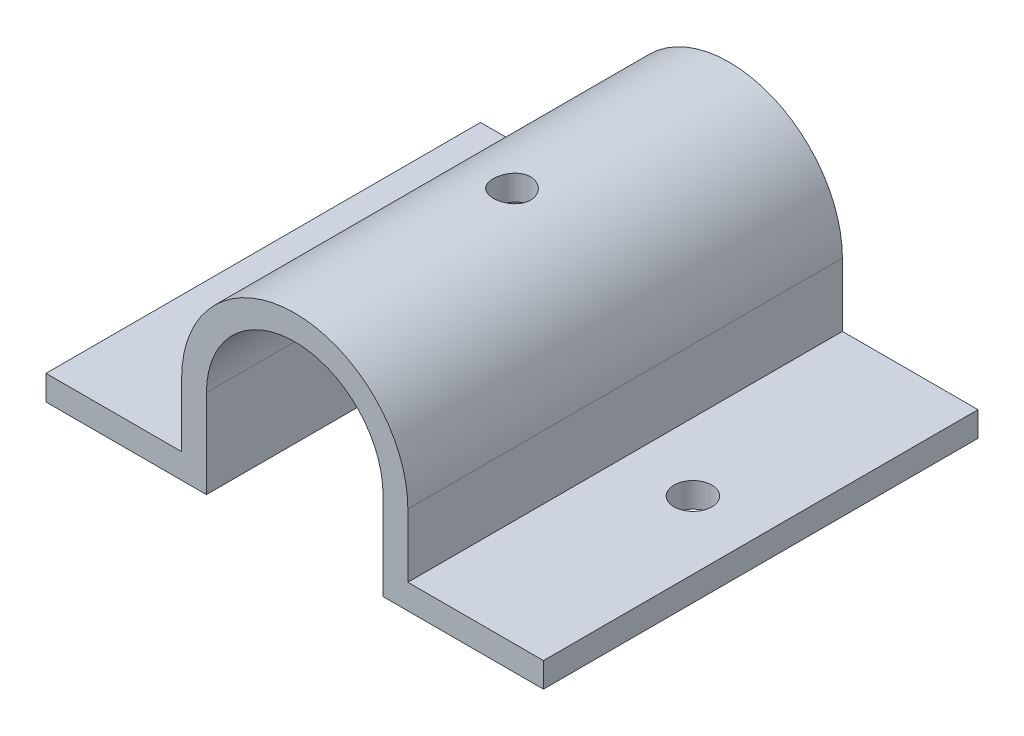
ISO-10303-21;
HEADER;
FILE_DESCRIPTION(('STEP AP214'),'2;1');
FILE_NAME('part.step','',(''),(''),'','','');
FILE_SCHEMA(('AUTOMOTIVE_DESIGN { 1 0 10303 214 1 1 1 1 }'));
ENDSEC;
DATA;
#1=APPLICATION_CONTEXT('core data for automotive mechanical design processes');
#2=APPLICATION_PROTOCOL_DEFINITION('international standard','automotive_design',2000,#1);
#3=PRODUCT_CONTEXT('',#1,'mechanical');
#4=PRODUCT('Part','Part','',(#3));
#5=PRODUCT_RELATED_PRODUCT_CATEGORY('part','',(#4));
#6=PRODUCT_DEFINITION_FORMATION('','',#4);
#7=PRODUCT_DEFINITION_CONTEXT('part definition',#1,'design');
#8=PRODUCT_DEFINITION('design','',#6,#7);
#9=PRODUCT_DEFINITION_SHAPE('','',#8);
#10=(LENGTH_UNIT() NAMED_UNIT(*) SI_UNIT(.MILLI.,.METRE.));
#11=(NAMED_UNIT(*) PLANE_ANGLE_UNIT() SI_UNIT($,.RADIAN.));
#12=(NAMED_UNIT(*) SI_UNIT($,.STERADIAN.) SOLID_ANGLE_UNIT());
#13=UNCERTAINTY_MEASURE_WITH_UNIT(LENGTH_MEASURE(1.E-05),#10,'distance_accuracy_value','');
#14=(GEOMETRIC_REPRESENTATION_CONTEXT(3) GLOBAL_UNCERTAINTY_ASSIGNED_CONTEXT((#13)) GLOBAL_UNIT_ASSIGNED_CONTEXT((#10,
#11,#12)) REPRESENTATION_CONTEXT('',''));
#15=CARTESIAN_POINT('',(0.,0.,0.));
#16=DIRECTION('',(0.,0.,1.));
#17=DIRECTION('',(1.,0.,0.));
#18=AXIS2_PLACEMENT_3D('',#15,#16,#17);
#19=CARTESIAN_POINT('',(0.,10.224,70.));
#20=DIRECTION('',(0.,0.,-1.));
#21=DIRECTION('',(-1.,0.,0.));
#22=AXIS2_PLACEMENT_3D('',#19,#20,#21);
#23=CYLINDRICAL_SURFACE('',#22,18.224);
#24=DIRECTION('',(0.,0.,-1.));
#25=VECTOR('',#24,1.);
#26=CARTESIAN_POINT('',(-18.224,10.224,70.));
#27=LINE('',#26,#25);
#28=CARTESIAN_POINT('',(-18.224,10.224,70.));
#29=VERTEX_POINT('',#28);
#30=CARTESIAN_POINT('',(-18.224,10.224,0.));
#31=VERTEX_POINT('',#30);
#32=EDGE_CURVE('E185',#29,#31,#27,.T.);
#33=ORIENTED_EDGE('',*,*,#32,.F.);
#34=CARTESIAN_POINT('',(0.,10.224,70.));
#35=DIRECTION('',(0.,0.,1.));
#36=DIRECTION('',(1.,0.,0.));
#37=AXIS2_PLACEMENT_3D('',#34,#35,#36);
#38=CIRCLE('',#37,18.224);
#39=CARTESIAN_POINT('',(18.224,10.224,70.));
#40=VERTEX_POINT('',#39);
#41=EDGE_CURVE('E56',#40,#29,#38,.T.);
#42=ORIENTED_EDGE('',*,*,#41,.F.);
#43=DIRECTION('',(0.,0.,-1.));
#44=VECTOR('',#43,1.);
#45=CARTESIAN_POINT('',(18.224,10.224,70.));
#46=LINE('',#45,#44);
#47=CARTESIAN_POINT('',(18.224,10.224,0.));
#48=VERTEX_POINT('',#47);
#49=EDGE_CURVE('E189',#48,#40,#46,.F.);
#50=ORIENTED_EDGE('',*,*,#49,.F.);
#51=CARTESIAN_POINT('',(0.,10.224,0.));
#52=DIRECTION('',(0.,0.,1.));
#53=DIRECTION('',(1.,0.,0.));
#54=AXIS2_PLACEMENT_3D('',#51,#52,#53);
#55=CIRCLE('',#54,18.224);
#56=EDGE_CURVE('E11',#31,#48,#55,.F.);
#57=ORIENTED_EDGE('',*,*,#56,.F.);
#58=EDGE_LOOP('',(#33,#42,#50,#57));
#59=FACE_BOUND('',#58,.T.);
#60=CARTESIAN_POINT('',(0.,28.448,32.));
#61=CARTESIAN_POINT('',(0.167299124044914,28.4479971539085,32.0000067341063));
#62=CARTESIAN_POINT('',(0.334690294820282,28.445672237168,32.0140417688915));
#63=CARTESIAN_POINT('',(0.664779884903891,28.4366215461761,32.0697889102327));
#64=CARTESIAN_POINT('',(0.827473810437679,28.4298916945475,32.1115266599904));
#65=CARTESIAN_POINT('',(1.14334525844181,28.4127861608961,32.2213865903458));
#66=CARTESIAN_POINT('',(1.29653037349707,28.4024134328713,32.2894873977791));
#67=CARTESIAN_POINT('',(1.58927966007172,28.3791633858742,32.4500848202931));
#68=CARTESIAN_POINT('',(1.7288454293843,28.3662863612326,32.5425785689195));
#69=CARTESIAN_POINT('',(1.99171731585958,28.3393213718147,32.7502551103151));
#70=CARTESIAN_POINT('',(2.11487783283978,28.3252241880854,32.8656210228177));
#71=CARTESIAN_POINT('',(2.34018562746127,28.2974784864303,33.115372935266));
#72=CARTESIAN_POINT('',(2.44233159423126,28.2838299965385,33.2497601208618));
#73=CARTESIAN_POINT('',(2.62329211089869,28.2584377082811,33.5347372042175));
#74=CARTESIAN_POINT('',(2.70196307924593,28.2467058223177,33.6854194302803));
#75=CARTESIAN_POINT('',(2.83282231482439,28.2266027076354,33.9980852336073));
#76=CARTESIAN_POINT('',(2.88501232608604,28.2182312576064,34.1600680658162));
#77=CARTESIAN_POINT('',(2.96097025680633,28.205888481575,34.4891951102072));
#78=CARTESIAN_POINT('',(2.98498928001448,28.2018783048586,34.6562798867601));
#79=CARTESIAN_POINT('',(3.00470188721067,28.1985945419204,34.992152592287));
#80=CARTESIAN_POINT('',(3.00039742694859,28.1993206286575,35.160940402862));
#81=CARTESIAN_POINT('',(2.96378987339782,28.2053918759166,35.4936377999609));
#82=CARTESIAN_POINT('',(2.93176854940041,28.2106905499457,35.6575793619086));
#83=CARTESIAN_POINT('',(2.84107828655088,28.225237196098,35.9777308254392));
#84=CARTESIAN_POINT('',(2.78240845415425,28.2344853006482,36.1339404675702));
#85=CARTESIAN_POINT('',(2.63979997609019,28.2559391406125,36.4350391673364));
#86=CARTESIAN_POINT('',(2.55574402465862,28.2681585538277,36.5798716511803));
#87=CARTESIAN_POINT('',(2.36483266723982,28.2941686451239,36.8534831251096));
#88=CARTESIAN_POINT('',(2.25797546507636,28.3079594469517,36.982260849209));
#89=CARTESIAN_POINT('',(2.02295820200398,28.3357628440847,37.2217385483281));
#90=CARTESIAN_POINT('',(1.89455632225164,28.3497761057749,37.3322012687672));
#91=CARTESIAN_POINT('',(1.62091321950006,28.3762913442798,37.5300486117945));
#92=CARTESIAN_POINT('',(1.47567189286951,28.3887933117928,37.6174330923464));
#93=CARTESIAN_POINT('',(1.17225192263358,28.4108944542093,37.766663812495));
#94=CARTESIAN_POINT('',(1.01406295694143,28.4204912838797,37.8284894338115));
#95=CARTESIAN_POINT('',(0.689353554083484,28.4356819221253,37.9246290414899));
#96=CARTESIAN_POINT('',(0.522833797832243,28.4412760572893,37.9589452724329));
#97=CARTESIAN_POINT('',(0.188234965941305,28.4477871680977,37.9987711484278));
#98=CARTESIAN_POINT('',(0.0201956574261365,28.4487570330075,38.0046065561587));
#99=CARTESIAN_POINT('',(-0.314459906102683,28.4460550710995,37.9881731454562));
#100=CARTESIAN_POINT('',(-0.48107621425219,28.4423834183689,37.9659053810757));
#101=CARTESIAN_POINT('',(-0.807152432989453,28.4308437140995,37.8941686696864));
#102=CARTESIAN_POINT('',(-0.966648707284983,28.4230005008464,37.8448606720651));
#103=CARTESIAN_POINT('',(-1.27511087521852,28.4039936851116,37.7206145075309));
#104=CARTESIAN_POINT('',(-1.42407618902093,28.3928298999749,37.6456749306653));
#105=CARTESIAN_POINT('',(-1.70866509770227,28.3682894647038,37.471544440836));
#106=CARTESIAN_POINT('',(-1.84416232963958,28.3548945325588,37.3721496333929));
#107=CARTESIAN_POINT('',(-2.09667012254975,28.3274337156497,37.152211048991));
#108=CARTESIAN_POINT('',(-2.21367937442292,28.313367783465,37.0316657756811));
#109=CARTESIAN_POINT('',(-2.42709443529209,28.2859796912587,36.7713884227259));
#110=CARTESIAN_POINT('',(-2.52328036173882,28.272666471563,36.6314749613636));
#111=CARTESIAN_POINT('',(-2.69078368595544,28.2484570435089,36.3372850671211));
#112=CARTESIAN_POINT('',(-2.76210185792337,28.2375607599088,36.1830090815731));
#113=CARTESIAN_POINT('',(-2.87751482008493,28.2194857088285,35.8650935095243));
#114=CARTESIAN_POINT('',(-2.92171985852187,28.2122919056842,35.7014948398381));
#115=CARTESIAN_POINT('',(-2.98199919531677,28.2023983146206,35.3690663841174));
#116=CARTESIAN_POINT('',(-2.99807587380651,28.1996981464652,35.200237041916));
#117=CARTESIAN_POINT('',(-3.00157700134136,28.1991136589167,34.8643348324813));
#118=CARTESIAN_POINT('',(-2.98934750480094,28.2011711746202,34.6972655722682));
#119=CARTESIAN_POINT('',(-2.9373308555924,28.2097428851364,34.3675961425262));
#120=CARTESIAN_POINT('',(-2.89754378602022,28.2162570665107,34.204995959523));
#121=CARTESIAN_POINT('',(-2.79167267970661,28.2329862461924,33.8890092785143));
#122=CARTESIAN_POINT('',(-2.72561772162453,28.2431971510957,33.735612807346));
#123=CARTESIAN_POINT('',(-2.56912129022992,28.2661733557303,33.4420231486762));
#124=CARTESIAN_POINT('',(-2.47867865597287,28.2789387770587,33.3018305901592));
#125=CARTESIAN_POINT('',(-2.27473630303179,28.3057704110737,33.0368786633187));
#126=CARTESIAN_POINT('',(-2.16098176883172,28.3198499723705,32.9123167594263));
#127=CARTESIAN_POINT('',(-1.91418223159012,28.3476163731598,32.6839304807071));
#128=CARTESIAN_POINT('',(-1.78113277946749,28.361303121202,32.5801109018724));
#129=CARTESIAN_POINT('',(-1.49845857099829,28.3868481902959,32.3955202875973));
#130=CARTESIAN_POINT('',(-1.34872842123199,28.3986936041133,32.3149088526077));
#131=CARTESIAN_POINT('',(-1.03771948484296,28.419095652842,32.1801055452658));
#132=CARTESIAN_POINT('',(-0.876452445689334,28.4276555782174,32.1258872251469));
#133=CARTESIAN_POINT('',(-0.59545499454717,28.4386431351784,32.0572458530717));
#134=CARTESIAN_POINT('',(-0.477429107535469,28.4421332991642,32.0358128354397));
#135=CARTESIAN_POINT('',(-0.239617869195298,28.446812731827,32.0071876150236));
#136=CARTESIAN_POINT('',(-0.119832547024065,28.4480020385904,31.9999951765132));
#137=CARTESIAN_POINT('',(0.,28.448,32.));
#138=B_SPLINE_CURVE_WITH_KNOTS('',3,(#60,#61,#62,#63,#64,#65,#66,#67,#68,#69,#70,#71,#72,#73,
#74,#75,#76,#77,#78,#79,#80,#81,#82,#83,#84,#85,#86,#87,#88,#89,#90,#91,#92,#93,#94,#95,#96,#97,
#98,#99,#100,#101,#102,#103,#104,#105,#106,#107,#108,#109,#110,#111,#112,#113,#114,#115,#116,
#117,#118,#119,#120,#121,#122,#123,#124,#125,#126,#127,#128,#129,#130,#131,#132,#133,#134,#135,
#136,#137),.UNSPECIFIED.,.T.,.F.,(4,2,2,2,2,2,2,2,2,2,2,2,2,2,2,2,2,2,2,2,2,2,2,2,2,2,2,2,2,2,2,
2,2,2,2,2,2,2,4),(0.,0.501459367682181,1.00338356311634,1.50490168587903,2.00636090066942,
2.51201002991263,3.01769069159789,3.52640370326369,4.03508320684409,4.53919325105569,
5.04326848659663,5.54227869450985,6.04130563584572,6.54267474041433,7.04408335509407,
7.55155095701753,8.05902168210316,8.56690098769929,9.07473884954361,9.57675424317567,
10.0787508085056,10.5777913103657,11.0768592680726,11.5802382412802,12.0836528418643,
12.5921486783943,13.1006286827089,13.6070271403269,14.1133827460558,14.6135807004621,
15.1137771465992,15.6134214078134,16.1130894581617,16.618542294198,17.1241118649542,
17.633079399182,18.1415358566704,18.5007257109108,18.8599096193831),.UNSPECIFIED.);
#139=CARTESIAN_POINT('',(0.,28.448,32.));
#140=VERTEX_POINT('',#139);
#141=EDGE_CURVE('E306',#140,#140,#138,.T.);
#142=ORIENTED_EDGE('',*,*,#141,.T.);
#143=EDGE_LOOP('',(#142));
#144=FACE_BOUND('',#143,.T.);
#145=ADVANCED_FACE('F41',(#59,#144),#23,.T.);
#146=CARTESIAN_POINT('',(0.,10.224,0.));
#147=DIRECTION('',(0.,0.,-1.));
#148=DIRECTION('',(-1.,0.,0.));
#149=AXIS2_PLACEMENT_3D('',#146,#147,#148);
#150=CYLINDRICAL_SURFACE('',#149,14.224);
#151=DIRECTION('',(0.,0.,1.));
#152=VECTOR('',#151,1.);
#153=CARTESIAN_POINT('',(-14.224,10.224,0.));
#154=LINE('',#153,#152);
#155=CARTESIAN_POINT('',(-14.224,10.224,0.));
#156=VERTEX_POINT('',#155);
#157=CARTESIAN_POINT('',(-14.224,10.224,70.));
#158=VERTEX_POINT('',#157);
#159=EDGE_CURVE('E165',#156,#158,#154,.T.);
#160=ORIENTED_EDGE('',*,*,#159,.F.);
#161=CARTESIAN_POINT('',(0.,10.224,0.));
#162=DIRECTION('',(0.,0.,1.));
#163=DIRECTION('',(1.,0.,0.));
#164=AXIS2_PLACEMENT_3D('',#161,#162,#163);
#165=CIRCLE('',#164,14.224);
#166=CARTESIAN_POINT('',(14.224,10.224,0.));
#167=VERTEX_POINT('',#166);
#168=EDGE_CURVE('E179',#156,#167,#165,.F.);
#169=ORIENTED_EDGE('',*,*,#168,.T.);
#170=DIRECTION('',(0.,0.,1.));
#171=VECTOR('',#170,1.);
#172=CARTESIAN_POINT('',(14.224,10.224,0.));
#173=LINE('',#172,#171);
#174=CARTESIAN_POINT('',(14.224,10.224,70.));
#175=VERTEX_POINT('',#174);
#176=EDGE_CURVE('E170',#175,#167,#173,.F.);
#177=ORIENTED_EDGE('',*,*,#176,.F.);
#178=CARTESIAN_POINT('',(0.,10.224,70.));
#179=DIRECTION('',(0.,0.,1.));
#180=DIRECTION('',(1.,0.,0.));
#181=AXIS2_PLACEMENT_3D('',#178,#179,#180);
#182=CIRCLE('',#181,14.224);
#183=EDGE_CURVE('E182',#175,#158,#182,.T.);
#184=ORIENTED_EDGE('',*,*,#183,.T.);
#185=EDGE_LOOP('',(#160,#169,#177,#184));
#186=FACE_BOUND('',#185,.T.);
#187=CARTESIAN_POINT('',(0.,24.448,32.));
#188=CARTESIAN_POINT('',(0.166534448824368,24.4479969171993,32.0000058837209));
#189=CARTESIAN_POINT('',(0.333141369406627,24.4450454766761,32.0139136958404));
#190=CARTESIAN_POINT('',(0.661632670716217,24.4335564990513,32.0691255421016));
#191=CARTESIAN_POINT('',(0.823513420733723,24.4250147795509,32.1104500885462));
#192=CARTESIAN_POINT('',(1.13775663539406,24.4032974768358,32.219151353765));
#193=CARTESIAN_POINT('',(1.29012851240539,24.3901265643387,32.28650181995));
#194=CARTESIAN_POINT('',(1.58140202253015,24.3605767762521,32.4452620059277));
#195=CARTESIAN_POINT('',(1.72030419628154,24.3441980294964,32.5366707595375));
#196=CARTESIAN_POINT('',(1.98278359023566,24.3097561047365,32.7424028755333));
#197=CARTESIAN_POINT('',(2.10613007766223,24.2916732677522,32.8570173498451));
#198=CARTESIAN_POINT('',(2.3319972546501,24.2560016378524,33.1052820938101));
#199=CARTESIAN_POINT('',(2.43451618887704,24.2384128866857,33.238933966311));
#200=CARTESIAN_POINT('',(2.61682078371807,24.2055278958289,33.5231658480152));
#201=CARTESIAN_POINT('',(2.69636368169512,24.1902568928848,33.6739047432992));
#202=CARTESIAN_POINT('',(2.82890192704633,24.1640173835291,33.986984324168));
#203=CARTESIAN_POINT('',(2.88190021062039,24.1530484012838,34.1493237243063));
#204=CARTESIAN_POINT('',(2.95908799837252,24.1368545620503,34.4785017724602));
#205=CARTESIAN_POINT('',(2.98368446341771,24.1315486465746,34.6452409223954));
#206=CARTESIAN_POINT('',(3.00463524003697,24.1270380289074,34.980557085779));
#207=CARTESIAN_POINT('',(3.00099277174928,24.1278326310622,35.1491338874874));
#208=CARTESIAN_POINT('',(2.96589723086016,24.135359770301,35.4803353288221));
#209=CARTESIAN_POINT('',(2.93491423009095,24.1419919359762,35.6430124037562));
#210=CARTESIAN_POINT('',(2.84676067908167,24.1602885123523,35.9608065527089));
#211=CARTESIAN_POINT('',(2.78958875257814,24.1719531875165,36.1159232289441));
#212=CARTESIAN_POINT('',(2.65024129480415,24.1991009603208,36.4155290429559));
#213=CARTESIAN_POINT('',(2.56788264020845,24.2146118607556,36.559930385678));
#214=CARTESIAN_POINT('',(2.38062853387459,24.2476870090461,36.8330383972366));
#215=CARTESIAN_POINT('',(2.27573021520629,24.2652515179807,36.9617430662687));
#216=CARTESIAN_POINT('',(2.04387393750525,24.3008872564116,37.2025132686311));
#217=CARTESIAN_POINT('',(1.91651561630804,24.3189615820658,37.3141931597636));
#218=CARTESIAN_POINT('',(1.64467659983275,24.3532587615725,37.5146690250277));
#219=CARTESIAN_POINT('',(1.50019563520568,24.3694815862921,37.6034646391067));
#220=CARTESIAN_POINT('',(1.19776003968224,24.3982948808393,37.7557363514558));
#221=CARTESIAN_POINT('',(1.03978066152958,24.4108784852319,37.8191646791863));
#222=CARTESIAN_POINT('',(0.715082614326171,24.4309440629264,37.9184702765698));
#223=CARTESIAN_POINT('',(0.548365128301941,24.4384267249183,37.9543512655353));
#224=CARTESIAN_POINT('',(0.214233854025719,24.4473502021502,37.9969891392868));
#225=CARTESIAN_POINT('',(0.0468901749998554,24.448900372092,38.004273221883));
#226=CARTESIAN_POINT('',(-0.286622875356345,24.4460894903316,37.9909355511944));
#227=CARTESIAN_POINT('',(-0.452792319810776,24.4417288100405,37.9703155512758));
#228=CARTESIAN_POINT('',(-0.777512848720063,24.4276549612312,37.9021925936075));
#229=CARTESIAN_POINT('',(-0.936123978959533,24.4179963631904,37.8549635859079));
#230=CARTESIAN_POINT('',(-1.24317423803891,24.394406738049,37.735265325538));
#231=CARTESIAN_POINT('',(-1.39161254221399,24.380475365074,37.6627940294796));
#232=CARTESIAN_POINT('',(-1.67630212939961,24.3496145124865,37.4935520086599));
#233=CARTESIAN_POINT('',(-1.81236315950423,24.3326473121614,37.3964682790258));
#234=CARTESIAN_POINT('',(-2.06645190042335,24.2976786696516,37.1811723504249));
#235=CARTESIAN_POINT('',(-2.18447744155508,24.2796771033898,37.0629576130882));
#236=CARTESIAN_POINT('',(-2.40120813985781,24.2442947616685,36.8063440862841));
#237=CARTESIAN_POINT('',(-2.49954953336831,24.2269298059499,36.6676354958221));
#238=CARTESIAN_POINT('',(-2.67154102687901,24.1951390157046,36.3753601364613));
#239=CARTESIAN_POINT('',(-2.74519216598177,24.1807130574986,36.2217939932011));
#240=CARTESIAN_POINT('',(-2.86523387773224,24.1565648721724,35.9049689312993));
#241=CARTESIAN_POINT('',(-2.91177324014204,24.1468170245508,35.7417684353263));
#242=CARTESIAN_POINT('',(-2.97671326593432,24.1330789000531,35.4096336102171));
#243=CARTESIAN_POINT('',(-2.99511806893683,24.1290877761579,35.2407001283521));
#244=CARTESIAN_POINT('',(-3.00310006654725,24.1273656763544,34.9055556159256));
#245=CARTESIAN_POINT('',(-2.9932531455964,24.1295096401835,34.7393586809924));
#246=CARTESIAN_POINT('',(-2.9462916168691,24.1395347702751,34.411048466695));
#247=CARTESIAN_POINT('',(-2.90917728492387,24.1474158785018,34.248935146039));
#248=CARTESIAN_POINT('',(-2.80900373402067,24.1679684623819,33.9338125192474));
#249=CARTESIAN_POINT('',(-2.74602270024136,24.1806254929548,33.7807773549646));
#250=CARTESIAN_POINT('',(-2.59597290090526,24.2093104998046,33.4873582635846));
#251=CARTESIAN_POINT('',(-2.50890183169956,24.2253387984295,33.3469755481014));
#252=CARTESIAN_POINT('',(-2.31120919845114,24.2593378254488,33.0799950302903));
#253=CARTESIAN_POINT('',(-2.20017484772819,24.2773394601022,32.9537067647538));
#254=CARTESIAN_POINT('',(-1.958550927633,24.3130432377373,32.7213654986798));
#255=CARTESIAN_POINT('',(-1.82795685860261,24.3307453107599,32.6153171670824));
#256=CARTESIAN_POINT('',(-1.54905312459413,24.3641042450931,32.4252667773905));
#257=CARTESIAN_POINT('',(-1.40055145878581,24.3797343158331,32.3415415471158));
#258=CARTESIAN_POINT('',(-1.09129036309366,24.4069217656406,32.2003704721964));
#259=CARTESIAN_POINT('',(-0.930541685674144,24.4184826683,32.1429018783708));
#260=CARTESIAN_POINT('',(-0.641286551126832,24.4340875784062,32.0664996179819));
#261=CARTESIAN_POINT('',(-0.514381390259267,24.4392731918905,32.0416084879343));
#262=CARTESIAN_POINT('',(-0.25833196566587,24.4462305324173,32.0083567163952));
#263=CARTESIAN_POINT('',(-0.129187788710093,24.4480023914584,31.9999954357498));
#264=CARTESIAN_POINT('',(0.,24.448,32.));
#265=B_SPLINE_CURVE_WITH_KNOTS('',3,(#187,#188,#189,#190,#191,#192,#193,#194,#195,#196,#197,
#198,#199,#200,#201,#202,#203,#204,#205,#206,#207,#208,#209,#210,#211,#212,#213,#214,#215,#216,
#217,#218,#219,#220,#221,#222,#223,#224,#225,#226,#227,#228,#229,#230,#231,#232,#233,#234,#235,
#236,#237,#238,#239,#240,#241,#242,#243,#244,#245,#246,#247,#248,#249,#250,#251,#252,#253,#254,
#255,#256,#257,#258,#259,#260,#261,#262,#263,#264),.UNSPECIFIED.,.T.,.F.,(4,2,2,2,2,2,2,2,2,2,2,
2,2,2,2,2,2,2,2,2,2,2,2,2,2,2,2,2,2,2,2,2,2,2,2,2,2,2,4),(0.,0.49913058506545,0.998635025045061,
1.49763691994803,1.99661877794858,2.50229844213019,3.00802070704261,3.51890576316203,
4.02973429587169,4.53314876329099,5.03650582626391,5.53137359271769,6.02626736812577,
6.52484850490349,7.02349309623483,7.53214209700816,8.04079910018367,8.55040952344167,
9.05995112938426,9.56005371061145,10.0601248691147,10.5551392873065,11.0501937867191,
11.5518909953484,12.0536485110913,12.5639618692614,13.0742537479239,13.5817180944475,
14.0891077672643,14.5862287166005,15.0833446372381,15.5789688968729,16.0746405677764,
16.5796507137553,17.0847772148468,17.5959036116928,18.1065863165061,18.4937979141632,
18.8809945393502),.UNSPECIFIED.);
#266=CARTESIAN_POINT('',(0.,24.448,32.));
#267=VERTEX_POINT('',#266);
#268=EDGE_CURVE('E46',#267,#267,#265,.T.);
#269=ORIENTED_EDGE('',*,*,#268,.F.);
#270=EDGE_LOOP('',(#269));
#271=FACE_BOUND('',#270,.T.);
#272=ADVANCED_FACE('F362',(#186,#271),#150,.F.);
#273=CARTESIAN_POINT('',(-40.068,0.,70.));
#274=DIRECTION('',(1.,0.,0.));
#275=DIRECTION('',(0.,0.,-1.));
#276=AXIS2_PLACEMENT_3D('',#273,#274,#275);
#277=PLANE('',#276);
#278=DIRECTION('',(0.,-1.,0.));
#279=VECTOR('',#278,1.);
#280=CARTESIAN_POINT('',(-40.068,0.,0.));
#281=LINE('',#280,#279);
#282=CARTESIAN_POINT('',(-40.068,0.,0.));
#283=VERTEX_POINT('',#282);
#284=CARTESIAN_POINT('',(-40.068,-4.,0.));
#285=VERTEX_POINT('',#284);
#286=EDGE_CURVE('E163',#283,#285,#281,.T.);
#287=ORIENTED_EDGE('',*,*,#286,.T.);
#288=DIRECTION('',(0.,0.,-1.));
#289=VECTOR('',#288,1.);
#290=CARTESIAN_POINT('',(-40.068,-4.,70.));
#291=LINE('',#290,#289);
#292=CARTESIAN_POINT('',(-40.068,-4.,70.));
#293=VERTEX_POINT('',#292);
#294=EDGE_CURVE('E139',#293,#285,#291,.T.);
#295=ORIENTED_EDGE('',*,*,#294,.F.);
#296=DIRECTION('',(0.,-1.,0.));
#297=VECTOR('',#296,1.);
#298=CARTESIAN_POINT('',(-40.068,0.,70.));
#299=LINE('',#298,#297);
#300=CARTESIAN_POINT('',(-40.068,0.,70.));
#301=VERTEX_POINT('',#300);
#302=EDGE_CURVE('E148',#301,#293,#299,.T.);
#303=ORIENTED_EDGE('',*,*,#302,.F.);
#304=DIRECTION('',(0.,0.,-1.));
#305=VECTOR('',#304,1.);
#306=CARTESIAN_POINT('',(-40.068,0.,70.));
#307=LINE('',#306,#305);
#308=EDGE_CURVE('E207',#301,#283,#307,.T.);
#309=ORIENTED_EDGE('',*,*,#308,.T.);
#310=EDGE_LOOP('',(#287,#295,#303,#309));
#311=FACE_BOUND('',#310,.T.);
#312=ADVANCED_FACE('F161',(#311),#277,.F.);
#313=CARTESIAN_POINT('',(-40.068,-4.,70.));
#314=DIRECTION('',(0.,1.,0.));
#315=DIRECTION('',(0.,0.,1.));
#316=AXIS2_PLACEMENT_3D('',#313,#314,#315);
#317=PLANE('',#316);
#318=CARTESIAN_POINT('',(-31.2802538658096,-4.,35.));
#319=DIRECTION('',(0.,1.,0.));
#320=DIRECTION('',(0.,0.,1.));
#321=AXIS2_PLACEMENT_3D('',#318,#319,#320);
#322=CIRCLE('',#321,3.048);
#323=CARTESIAN_POINT('',(-31.2802538658096,-4.,38.048));
#324=VERTEX_POINT('',#323);
#325=EDGE_CURVE('E297',#324,#324,#322,.T.);
#326=ORIENTED_EDGE('',*,*,#325,.T.);
#327=EDGE_LOOP('',(#326));
#328=FACE_BOUND('',#327,.T.);
#329=DIRECTION('',(1.,0.,0.));
#330=VECTOR('',#329,1.);
#331=CARTESIAN_POINT('',(-40.068,-4.,0.));
#332=LINE('',#331,#330);
#333=CARTESIAN_POINT('',(-14.224,-4.,0.));
#334=VERTEX_POINT('',#333);
#335=EDGE_CURVE('E215',#285,#334,#332,.T.);
#336=ORIENTED_EDGE('',*,*,#335,.T.);
#337=DIRECTION('',(0.,0.,-1.));
#338=VECTOR('',#337,1.);
#339=CARTESIAN_POINT('',(-14.224,-4.,70.));
#340=LINE('',#339,#338);
#341=CARTESIAN_POINT('',(-14.224,-4.,70.));
#342=VERTEX_POINT('',#341);
#343=EDGE_CURVE('E142',#342,#334,#340,.T.);
#344=ORIENTED_EDGE('',*,*,#343,.F.);
#345=DIRECTION('',(1.,0.,0.));
#346=VECTOR('',#345,1.);
#347=CARTESIAN_POINT('',(-40.068,-4.,70.));
#348=LINE('',#347,#346);
#349=EDGE_CURVE('E135',#293,#342,#348,.T.);
#350=ORIENTED_EDGE('',*,*,#349,.F.);
#351=ORIENTED_EDGE('',*,*,#294,.T.);
#352=EDGE_LOOP('',(#336,#344,#350,#351));
#353=FACE_BOUND('',#352,.T.);
#354=ADVANCED_FACE('F137',(#328,#353),#317,.F.);
#355=CARTESIAN_POINT('',(-14.224,-4.,70.));
#356=DIRECTION('',(-1.,0.,0.));
#357=DIRECTION('',(0.,0.,1.));
#358=AXIS2_PLACEMENT_3D('',#355,#356,#357);
#359=PLANE('',#358);
#360=DIRECTION('',(0.,1.,0.));
#361=VECTOR('',#360,1.);
#362=CARTESIAN_POINT('',(-14.224,-4.,0.));
#363=LINE('',#362,#361);
#364=EDGE_CURVE('E219',#334,#156,#363,.T.);
#365=ORIENTED_EDGE('',*,*,#364,.T.);
#366=ORIENTED_EDGE('',*,*,#159,.T.);
#367=DIRECTION('',(0.,1.,0.));
#368=VECTOR('',#367,1.);
#369=CARTESIAN_POINT('',(-14.224,-4.,70.));
#370=LINE('',#369,#368);
#371=EDGE_CURVE('E147',#342,#158,#370,.T.);
#372=ORIENTED_EDGE('',*,*,#371,.F.);
#373=ORIENTED_EDGE('',*,*,#343,.T.);
#374=EDGE_LOOP('',(#365,#366,#372,#373));
#375=FACE_BOUND('',#374,.T.);
#376=ADVANCED_FACE('F354',(#375),#359,.F.);
#377=CARTESIAN_POINT('',(14.224,24.448,70.));
#378=DIRECTION('',(1.,0.,0.));
#379=DIRECTION('',(0.,1.,0.));
#380=AXIS2_PLACEMENT_3D('',#377,#378,#379);
#381=PLANE('',#380);
#382=DIRECTION('',(0.,-1.,0.));
#383=VECTOR('',#382,1.);
#384=CARTESIAN_POINT('',(14.224,24.448,70.));
#385=LINE('',#384,#383);
#386=CARTESIAN_POINT('',(14.224,-4.,70.));
#387=VERTEX_POINT('',#386);
#388=EDGE_CURVE('E289',#175,#387,#385,.T.);
#389=ORIENTED_EDGE('',*,*,#388,.F.);
#390=ORIENTED_EDGE('',*,*,#176,.T.);
#391=DIRECTION('',(0.,-1.,0.));
#392=VECTOR('',#391,1.);
#393=CARTESIAN_POINT('',(14.224,24.448,0.));
#394=LINE('',#393,#392);
#395=CARTESIAN_POINT('',(14.224,-4.,0.));
#396=VERTEX_POINT('',#395);
#397=EDGE_CURVE('E223',#167,#396,#394,.T.);
#398=ORIENTED_EDGE('',*,*,#397,.T.);
#399=DIRECTION('',(0.,0.,-1.));
#400=VECTOR('',#399,1.);
#401=CARTESIAN_POINT('',(14.224,-4.,70.));
#402=LINE('',#401,#400);
#403=EDGE_CURVE('E172',#387,#396,#402,.T.);
#404=ORIENTED_EDGE('',*,*,#403,.F.);
#405=EDGE_LOOP('',(#389,#390,#398,#404));
#406=FACE_BOUND('',#405,.T.);
#407=ADVANCED_FACE('F350',(#406),#381,.F.);
#408=CARTESIAN_POINT('',(14.224,-4.,70.));
#409=DIRECTION('',(0.,1.,0.));
#410=DIRECTION('',(0.,0.,1.));
#411=AXIS2_PLACEMENT_3D('',#408,#409,#410);
#412=PLANE('',#411);
#413=CARTESIAN_POINT('',(29.146,-4.,35.));
#414=DIRECTION('',(0.,1.,0.));
#415=DIRECTION('',(0.,0.,1.));
#416=AXIS2_PLACEMENT_3D('',#413,#414,#415);
#417=CIRCLE('',#416,3.04800000000001);
#418=CARTESIAN_POINT('',(29.146,-4.,38.048));
#419=VERTEX_POINT('',#418);
#420=EDGE_CURVE('E216',#419,#419,#417,.T.);
#421=ORIENTED_EDGE('',*,*,#420,.T.);
#422=EDGE_LOOP('',(#421));
#423=FACE_BOUND('',#422,.T.);
#424=DIRECTION('',(1.,0.,0.));
#425=VECTOR('',#424,1.);
#426=CARTESIAN_POINT('',(14.224,-4.,0.));
#427=LINE('',#426,#425);
#428=CARTESIAN_POINT('',(40.068,-4.,0.));
#429=VERTEX_POINT('',#428);
#430=EDGE_CURVE('E226',#396,#429,#427,.T.);
#431=ORIENTED_EDGE('',*,*,#430,.T.);
#432=DIRECTION('',(0.,0.,-1.));
#433=VECTOR('',#432,1.);
#434=CARTESIAN_POINT('',(40.068,-4.,70.));
#435=LINE('',#434,#433);
#436=CARTESIAN_POINT('',(40.068,-4.,70.));
#437=VERTEX_POINT('',#436);
#438=EDGE_CURVE('E256',#437,#429,#435,.T.);
#439=ORIENTED_EDGE('',*,*,#438,.F.);
#440=DIRECTION('',(1.,0.,0.));
#441=VECTOR('',#440,1.);
#442=CARTESIAN_POINT('',(14.224,-4.,70.));
#443=LINE('',#442,#441);
#444=EDGE_CURVE('E267',#387,#437,#443,.T.);
#445=ORIENTED_EDGE('',*,*,#444,.F.);
#446=ORIENTED_EDGE('',*,*,#403,.T.);
#447=EDGE_LOOP('',(#431,#439,#445,#446));
#448=FACE_BOUND('',#447,.T.);
#449=ADVANCED_FACE('F265',(#423,#448),#412,.F.);
#450=CARTESIAN_POINT('',(40.068,0.,70.));
#451=DIRECTION('',(-1.,0.,0.));
#452=DIRECTION('',(0.,0.,1.));
#453=AXIS2_PLACEMENT_3D('',#450,#451,#452);
#454=PLANE('',#453);
#455=DIRECTION('',(0.,1.,0.));
#456=VECTOR('',#455,1.);
#457=CARTESIAN_POINT('',(40.068,0.,0.));
#458=LINE('',#457,#456);
#459=CARTESIAN_POINT('',(40.068,0.,0.));
#460=VERTEX_POINT('',#459);
#461=EDGE_CURVE('E229',#429,#460,#458,.T.);
#462=ORIENTED_EDGE('',*,*,#461,.T.);
#463=DIRECTION('',(0.,0.,-1.));
#464=VECTOR('',#463,1.);
#465=CARTESIAN_POINT('',(40.068,0.,70.));
#466=LINE('',#465,#464);
#467=CARTESIAN_POINT('',(40.068,0.,70.));
#468=VERTEX_POINT('',#467);
#469=EDGE_CURVE('E252',#468,#460,#466,.T.);
#470=ORIENTED_EDGE('',*,*,#469,.F.);
#471=DIRECTION('',(0.,1.,0.));
#472=VECTOR('',#471,1.);
#473=CARTESIAN_POINT('',(40.068,0.,70.));
#474=LINE('',#473,#472);
#475=EDGE_CURVE('E283',#437,#468,#474,.T.);
#476=ORIENTED_EDGE('',*,*,#475,.F.);
#477=ORIENTED_EDGE('',*,*,#438,.T.);
#478=EDGE_LOOP('',(#462,#470,#476,#477));
#479=FACE_BOUND('',#478,.T.);
#480=ADVANCED_FACE('F276',(#479),#454,.F.);
#481=CARTESIAN_POINT('',(18.224,0.,70.));
#482=DIRECTION('',(0.,-1.,0.));
#483=DIRECTION('',(0.,0.,-1.));
#484=AXIS2_PLACEMENT_3D('',#481,#482,#483);
#485=PLANE('',#484);
#486=CARTESIAN_POINT('',(29.146,0.,35.));
#487=DIRECTION('',(0.,1.,0.));
#488=DIRECTION('',(-1.,0.,0.));
#489=AXIS2_PLACEMENT_3D('',#486,#487,#488);
#490=CIRCLE('',#489,3.04800000000001);
#491=CARTESIAN_POINT('',(26.098,0.,35.));
#492=VERTEX_POINT('',#491);
#493=EDGE_CURVE('E302',#492,#492,#490,.T.);
#494=ORIENTED_EDGE('',*,*,#493,.F.);
#495=EDGE_LOOP('',(#494));
#496=FACE_BOUND('',#495,.T.);
#497=DIRECTION('',(-1.,0.,0.));
#498=VECTOR('',#497,1.);
#499=CARTESIAN_POINT('',(18.224,0.,0.));
#500=LINE('',#499,#498);
#501=CARTESIAN_POINT('',(18.224,0.,0.));
#502=VERTEX_POINT('',#501);
#503=EDGE_CURVE('E232',#460,#502,#500,.T.);
#504=ORIENTED_EDGE('',*,*,#503,.T.);
#505=DIRECTION('',(0.,0.,-1.));
#506=VECTOR('',#505,1.);
#507=CARTESIAN_POINT('',(18.224,0.,70.));
#508=LINE('',#507,#506);
#509=CARTESIAN_POINT('',(18.224,0.,70.));
#510=VERTEX_POINT('',#509);
#511=EDGE_CURVE('E248',#510,#502,#508,.T.);
#512=ORIENTED_EDGE('',*,*,#511,.F.);
#513=DIRECTION('',(-1.,0.,0.));
#514=VECTOR('',#513,1.);
#515=CARTESIAN_POINT('',(18.224,0.,70.));
#516=LINE('',#515,#514);
#517=EDGE_CURVE('E209',#468,#510,#516,.T.);
#518=ORIENTED_EDGE('',*,*,#517,.F.);
#519=ORIENTED_EDGE('',*,*,#469,.T.);
#520=EDGE_LOOP('',(#504,#512,#518,#519));
#521=FACE_BOUND('',#520,.T.);
#522=ADVANCED_FACE('F280',(#496,#521),#485,.F.);
#523=CARTESIAN_POINT('',(18.224,28.448,70.));
#524=DIRECTION('',(-1.,0.,0.));
#525=DIRECTION('',(0.,-1.,0.));
#526=AXIS2_PLACEMENT_3D('',#523,#524,#525);
#527=PLANE('',#526);
#528=DIRECTION('',(0.,1.,0.));
#529=VECTOR('',#528,1.);
#530=CARTESIAN_POINT('',(18.224,28.448,0.));
#531=LINE('',#530,#529);
#532=EDGE_CURVE('E235',#502,#48,#531,.T.);
#533=ORIENTED_EDGE('',*,*,#532,.T.);
#534=ORIENTED_EDGE('',*,*,#49,.T.);
#535=DIRECTION('',(0.,1.,0.));
#536=VECTOR('',#535,1.);
#537=CARTESIAN_POINT('',(18.224,28.448,70.));
#538=LINE('',#537,#536);
#539=EDGE_CURVE('E197',#510,#40,#538,.T.);
#540=ORIENTED_EDGE('',*,*,#539,.F.);
#541=ORIENTED_EDGE('',*,*,#511,.T.);
#542=EDGE_LOOP('',(#533,#534,#540,#541));
#543=FACE_BOUND('',#542,.T.);
#544=ADVANCED_FACE('F339',(#543),#527,.F.);
#545=CARTESIAN_POINT('',(-18.224,0.,70.));
#546=DIRECTION('',(1.,0.,0.));
#547=DIRECTION('',(0.,1.,0.));
#548=AXIS2_PLACEMENT_3D('',#545,#546,#547);
#549=PLANE('',#548);
#550=DIRECTION('',(0.,-1.,0.));
#551=VECTOR('',#550,1.);
#552=CARTESIAN_POINT('',(-18.224,0.,70.));
#553=LINE('',#552,#551);
#554=CARTESIAN_POINT('',(-18.224,0.,70.));
#555=VERTEX_POINT('',#554);
#556=EDGE_CURVE('E194',#29,#555,#553,.T.);
#557=ORIENTED_EDGE('',*,*,#556,.F.);
#558=ORIENTED_EDGE('',*,*,#32,.T.);
#559=DIRECTION('',(0.,-1.,0.));
#560=VECTOR('',#559,1.);
#561=CARTESIAN_POINT('',(-18.224,0.,0.));
#562=LINE('',#561,#560);
#563=CARTESIAN_POINT('',(-18.224,0.,0.));
#564=VERTEX_POINT('',#563);
#565=EDGE_CURVE('E239',#31,#564,#562,.T.);
#566=ORIENTED_EDGE('',*,*,#565,.T.);
#567=DIRECTION('',(0.,0.,-1.));
#568=VECTOR('',#567,1.);
#569=CARTESIAN_POINT('',(-18.224,0.,70.));
#570=LINE('',#569,#568);
#571=EDGE_CURVE('E202',#555,#564,#570,.T.);
#572=ORIENTED_EDGE('',*,*,#571,.F.);
#573=EDGE_LOOP('',(#557,#558,#566,#572));
#574=FACE_BOUND('',#573,.T.);
#575=ADVANCED_FACE('F200',(#574),#549,.F.);
#576=CARTESIAN_POINT('',(-40.068,0.,70.));
#577=DIRECTION('',(0.,-1.,0.));
#578=DIRECTION('',(0.,0.,-1.));
#579=AXIS2_PLACEMENT_3D('',#576,#577,#578);
#580=PLANE('',#579);
#581=CARTESIAN_POINT('',(-31.2802538658096,0.,35.));
#582=DIRECTION('',(0.,1.,0.));
#583=DIRECTION('',(-1.,0.,0.));
#584=AXIS2_PLACEMENT_3D('',#581,#582,#583);
#585=CIRCLE('',#584,3.048);
#586=CARTESIAN_POINT('',(-34.3282538658096,0.,35.));
#587=VERTEX_POINT('',#586);
#588=EDGE_CURVE('E301',#587,#587,#585,.T.);
#589=ORIENTED_EDGE('',*,*,#588,.F.);
#590=EDGE_LOOP('',(#589));
#591=FACE_BOUND('',#590,.T.);
#592=DIRECTION('',(-1.,0.,0.));
#593=VECTOR('',#592,1.);
#594=CARTESIAN_POINT('',(-40.068,0.,0.));
#595=LINE('',#594,#593);
#596=EDGE_CURVE('E159',#564,#283,#595,.T.);
#597=ORIENTED_EDGE('',*,*,#596,.T.);
#598=ORIENTED_EDGE('',*,*,#308,.F.);
#599=DIRECTION('',(-1.,0.,0.));
#600=VECTOR('',#599,1.);
#601=CARTESIAN_POINT('',(-40.068,0.,70.));
#602=LINE('',#601,#600);
#603=EDGE_CURVE('E154',#555,#301,#602,.T.);
#604=ORIENTED_EDGE('',*,*,#603,.F.);
#605=ORIENTED_EDGE('',*,*,#571,.T.);
#606=EDGE_LOOP('',(#597,#598,#604,#605));
#607=FACE_BOUND('',#606,.T.);
#608=ADVANCED_FACE('F331',(#591,#607),#580,.F.);
#609=CARTESIAN_POINT('',(0.,0.,70.));
#610=DIRECTION('',(0.,0.,1.));
#611=DIRECTION('',(1.,0.,0.));
#612=AXIS2_PLACEMENT_3D('',#609,#610,#611);
#613=PLANE('',#612);
#614=ORIENTED_EDGE('',*,*,#539,.T.);
#615=ORIENTED_EDGE('',*,*,#41,.T.);
#616=ORIENTED_EDGE('',*,*,#556,.T.);
#617=ORIENTED_EDGE('',*,*,#603,.T.);
#618=ORIENTED_EDGE('',*,*,#302,.T.);
#619=ORIENTED_EDGE('',*,*,#349,.T.);
#620=ORIENTED_EDGE('',*,*,#371,.T.);
#621=ORIENTED_EDGE('',*,*,#183,.F.);
#622=ORIENTED_EDGE('',*,*,#388,.T.);
#623=ORIENTED_EDGE('',*,*,#444,.T.);
#624=ORIENTED_EDGE('',*,*,#475,.T.);
#625=ORIENTED_EDGE('',*,*,#517,.T.);
#626=EDGE_LOOP('',(#614,#615,#616,#617,#618,#619,#620,#621,#622,#623,#624,#625));
#627=FACE_BOUND('',#626,.T.);
#628=ADVANCED_FACE('F152',(#627),#613,.T.);
#629=CARTESIAN_POINT('',(0.,0.,0.));
#630=DIRECTION('',(0.,0.,1.));
#631=DIRECTION('',(1.,0.,0.));
#632=AXIS2_PLACEMENT_3D('',#629,#630,#631);
#633=PLANE('',#632);
#634=ORIENTED_EDGE('',*,*,#565,.F.);
#635=ORIENTED_EDGE('',*,*,#56,.T.);
#636=ORIENTED_EDGE('',*,*,#532,.F.);
#637=ORIENTED_EDGE('',*,*,#503,.F.);
#638=ORIENTED_EDGE('',*,*,#461,.F.);
#639=ORIENTED_EDGE('',*,*,#430,.F.);
#640=ORIENTED_EDGE('',*,*,#397,.F.);
#641=ORIENTED_EDGE('',*,*,#168,.F.);
#642=ORIENTED_EDGE('',*,*,#364,.F.);
#643=ORIENTED_EDGE('',*,*,#335,.F.);
#644=ORIENTED_EDGE('',*,*,#286,.F.);
#645=ORIENTED_EDGE('',*,*,#596,.F.);
#646=EDGE_LOOP('',(#634,#635,#636,#637,#638,#639,#640,#641,#642,#643,#644,#645));
#647=FACE_BOUND('',#646,.T.);
#648=ADVANCED_FACE('F272',(#647),#633,.F.);
#649=CARTESIAN_POINT('',(-31.2802538658096,-70.,35.));
#650=DIRECTION('',(0.,1.,0.));
#651=DIRECTION('',(-1.,0.,0.));
#652=AXIS2_PLACEMENT_3D('',#649,#650,#651);
#653=CYLINDRICAL_SURFACE('',#652,3.048);
#654=ORIENTED_EDGE('',*,*,#588,.T.);
#655=EDGE_LOOP('',(#654));
#656=FACE_BOUND('',#655,.T.);
#657=ORIENTED_EDGE('',*,*,#325,.F.);
#658=EDGE_LOOP('',(#657));
#659=FACE_BOUND('',#658,.T.);
#660=ADVANCED_FACE('F321',(#656,#659),#653,.F.);
#661=CARTESIAN_POINT('',(29.146,-70.,35.));
#662=DIRECTION('',(0.,1.,0.));
#663=DIRECTION('',(-1.,0.,0.));
#664=AXIS2_PLACEMENT_3D('',#661,#662,#663);
#665=CYLINDRICAL_SURFACE('',#664,3.04800000000001);
#666=ORIENTED_EDGE('',*,*,#493,.T.);
#667=EDGE_LOOP('',(#666));
#668=FACE_BOUND('',#667,.T.);
#669=ORIENTED_EDGE('',*,*,#420,.F.);
#670=EDGE_LOOP('',(#669));
#671=FACE_BOUND('',#670,.T.);
#672=ADVANCED_FACE('F319',(#668,#671),#665,.F.);
#673=CARTESIAN_POINT('',(0.,70.,35.));
#674=DIRECTION('',(0.,-1.,0.));
#675=DIRECTION('',(0.,0.,-1.));
#676=AXIS2_PLACEMENT_3D('',#673,#674,#675);
#677=CYLINDRICAL_SURFACE('',#676,3.);
#678=ORIENTED_EDGE('',*,*,#141,.F.);
#679=EDGE_LOOP('',(#678));
#680=FACE_BOUND('',#679,.T.);
#681=ORIENTED_EDGE('',*,*,#268,.T.);
#682=EDGE_LOOP('',(#681));
#683=FACE_BOUND('',#682,.T.);
#684=ADVANCED_FACE('F315',(#680,#683),#677,.F.);
#685=CLOSED_SHELL('',(#145,#272,#312,#354,#376,#407,#449,#480,#522,#544,#575,#608,#628,#648,
#660,#672,#684));
#686=MANIFOLD_SOLID_BREP('B2',#685);
#687=ADVANCED_BREP_SHAPE_REPRESENTATION('',(#18,#686),#14);
#688=SHAPE_DEFINITION_REPRESENTATION(#9,#687);
ENDSEC;
END-ISO-10303-21;
